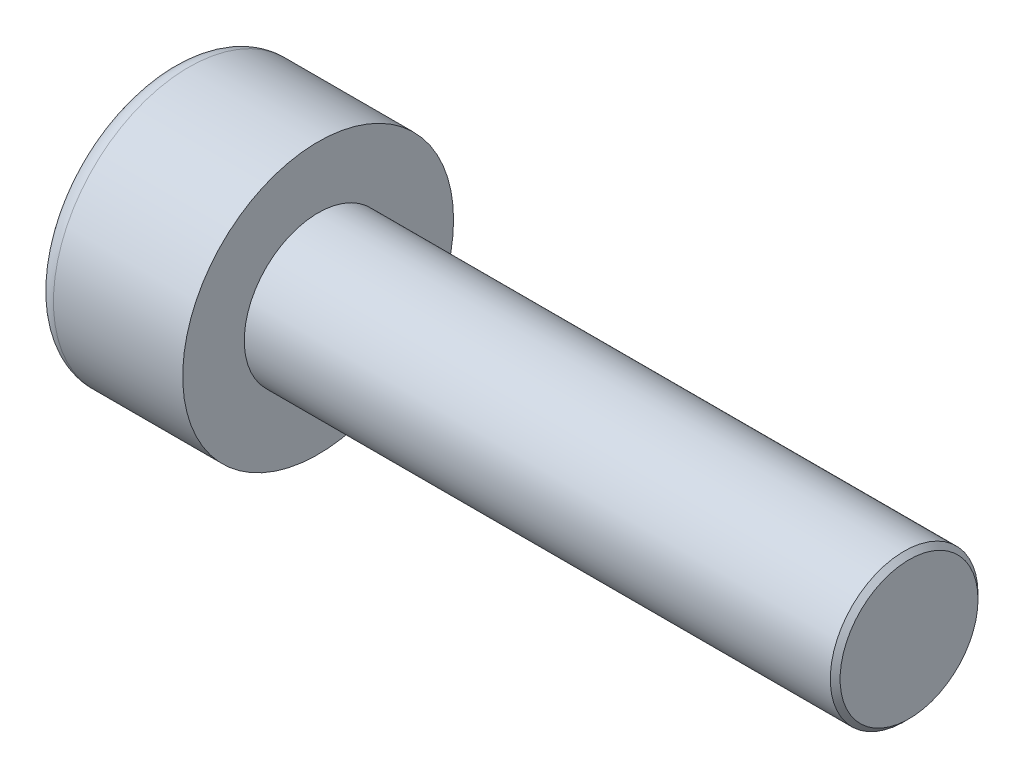
ISO-10303-21;
HEADER;
FILE_DESCRIPTION(('STEP AP214'),'2;1');
FILE_NAME('part.step','',(''),(''),'','','');
FILE_SCHEMA(('AUTOMOTIVE_DESIGN { 1 0 10303 214 1 1 1 1 }'));
ENDSEC;
DATA;
#1=APPLICATION_CONTEXT('core data for automotive mechanical design processes');
#2=APPLICATION_PROTOCOL_DEFINITION('international standard','automotive_design',2000,#1);
#3=PRODUCT_CONTEXT('',#1,'mechanical');
#4=PRODUCT('Part','Part','',(#3));
#5=PRODUCT_RELATED_PRODUCT_CATEGORY('part','',(#4));
#6=PRODUCT_DEFINITION_FORMATION('','',#4);
#7=PRODUCT_DEFINITION_CONTEXT('part definition',#1,'design');
#8=PRODUCT_DEFINITION('design','',#6,#7);
#9=PRODUCT_DEFINITION_SHAPE('','',#8);
#10=(LENGTH_UNIT() NAMED_UNIT(*) SI_UNIT(.MILLI.,.METRE.));
#11=(NAMED_UNIT(*) PLANE_ANGLE_UNIT() SI_UNIT($,.RADIAN.));
#12=(NAMED_UNIT(*) SI_UNIT($,.STERADIAN.) SOLID_ANGLE_UNIT());
#13=UNCERTAINTY_MEASURE_WITH_UNIT(LENGTH_MEASURE(1.E-05),#10,'distance_accuracy_value','');
#14=(GEOMETRIC_REPRESENTATION_CONTEXT(3) GLOBAL_UNCERTAINTY_ASSIGNED_CONTEXT((#13)) GLOBAL_UNIT_ASSIGNED_CONTEXT((#10,
#11,#12)) REPRESENTATION_CONTEXT('',''));
#15=CARTESIAN_POINT('',(0.,0.,0.));
#16=DIRECTION('',(0.,0.,1.));
#17=DIRECTION('',(1.,0.,0.));
#18=AXIS2_PLACEMENT_3D('',#15,#16,#17);
#19=CARTESIAN_POINT('',(1.3,-2.5,0.));
#20=DIRECTION('',(-1.,0.,0.));
#21=DIRECTION('',(0.,0.,1.));
#22=AXIS2_PLACEMENT_3D('',#19,#20,#21);
#23=PLANE('',#22);
#24=DIRECTION('',(0.,-0.866025403784438,-0.500000000000001));
#25=VECTOR('',#24,1.);
#26=CARTESIAN_POINT('',(1.3,0.,1.44337567297406));
#27=LINE('',#26,#25);
#28=CARTESIAN_POINT('',(1.3,-0.625,1.08253175473055));
#29=VERTEX_POINT('',#28);
#30=CARTESIAN_POINT('',(1.3,-1.25,0.721687836487031));
#31=VERTEX_POINT('',#30);
#32=EDGE_CURVE('E159',#29,#31,#27,.T.);
#33=ORIENTED_EDGE('',*,*,#32,.F.);
#34=CARTESIAN_POINT('',(1.3,0.,0.));
#35=DIRECTION('',(-1.,0.,0.));
#36=DIRECTION('',(0.,0.,1.));
#37=AXIS2_PLACEMENT_3D('',#34,#35,#36);
#38=CIRCLE('',#37,1.25);
#39=CARTESIAN_POINT('',(1.3,-1.25,0.));
#40=VERTEX_POINT('',#39);
#41=EDGE_CURVE('E54',#29,#40,#38,.F.);
#42=ORIENTED_EDGE('',*,*,#41,.T.);
#43=DIRECTION('',(0.,0.,-1.));
#44=VECTOR('',#43,1.);
#45=CARTESIAN_POINT('',(1.3,-1.25,0.721687836487031));
#46=LINE('',#45,#44);
#47=EDGE_CURVE('E164',#31,#40,#46,.T.);
#48=ORIENTED_EDGE('',*,*,#47,.F.);
#49=EDGE_LOOP('',(#33,#42,#48));
#50=FACE_BOUND('',#49,.T.);
#51=ADVANCED_FACE('F39',(#50),#23,.T.);
#52=CARTESIAN_POINT('',(1.3,-1.25,-0.721687836487037));
#53=VERTEX_POINT('',#52);
#54=EDGE_CURVE('E163',#40,#53,#46,.T.);
#55=ORIENTED_EDGE('',*,*,#54,.F.);
#56=CARTESIAN_POINT('',(1.3,-0.625,-1.08253175473055));
#57=VERTEX_POINT('',#56);
#58=EDGE_CURVE('E139',#40,#57,#38,.F.);
#59=ORIENTED_EDGE('',*,*,#58,.T.);
#60=DIRECTION('',(0.,0.866025403784438,-0.5));
#61=VECTOR('',#60,1.);
#62=CARTESIAN_POINT('',(1.3,-1.25,-0.721687836487037));
#63=LINE('',#62,#61);
#64=EDGE_CURVE('E147',#53,#57,#63,.T.);
#65=ORIENTED_EDGE('',*,*,#64,.F.);
#66=EDGE_LOOP('',(#55,#59,#65));
#67=FACE_BOUND('',#66,.T.);
#68=ADVANCED_FACE('F220',(#67),#23,.T.);
#69=CARTESIAN_POINT('',(1.3,0.,-1.44337567297407));
#70=VERTEX_POINT('',#69);
#71=EDGE_CURVE('E137',#57,#70,#63,.T.);
#72=ORIENTED_EDGE('',*,*,#71,.F.);
#73=CARTESIAN_POINT('',(1.3,0.625,-1.08253175473055));
#74=VERTEX_POINT('',#73);
#75=EDGE_CURVE('E121',#57,#74,#38,.F.);
#76=ORIENTED_EDGE('',*,*,#75,.T.);
#77=DIRECTION('',(0.,0.866025403784438,0.5));
#78=VECTOR('',#77,1.);
#79=CARTESIAN_POINT('',(1.3,0.,-1.44337567297407));
#80=LINE('',#79,#78);
#81=EDGE_CURVE('E135',#70,#74,#80,.T.);
#82=ORIENTED_EDGE('',*,*,#81,.F.);
#83=EDGE_LOOP('',(#72,#76,#82));
#84=FACE_BOUND('',#83,.T.);
#85=ADVANCED_FACE('F133',(#84),#23,.T.);
#86=CARTESIAN_POINT('',(1.3,1.25,-0.721687836487033));
#87=VERTEX_POINT('',#86);
#88=EDGE_CURVE('E141',#74,#87,#80,.T.);
#89=ORIENTED_EDGE('',*,*,#88,.F.);
#90=CARTESIAN_POINT('',(1.3,0.,0.));
#91=DIRECTION('',(1.,0.,0.));
#92=DIRECTION('',(0.,0.,-1.));
#93=AXIS2_PLACEMENT_3D('',#90,#91,#92);
#94=CIRCLE('',#93,1.25);
#95=CARTESIAN_POINT('',(1.3,1.25,0.));
#96=VERTEX_POINT('',#95);
#97=EDGE_CURVE('E119',#74,#96,#94,.T.);
#98=ORIENTED_EDGE('',*,*,#97,.T.);
#99=DIRECTION('',(0.,0.,1.));
#100=VECTOR('',#99,1.);
#101=CARTESIAN_POINT('',(1.3,1.25,-0.721687836487033));
#102=LINE('',#101,#100);
#103=EDGE_CURVE('E144',#87,#96,#102,.T.);
#104=ORIENTED_EDGE('',*,*,#103,.F.);
#105=EDGE_LOOP('',(#89,#98,#104));
#106=FACE_BOUND('',#105,.T.);
#107=ADVANCED_FACE('F142',(#106),#23,.T.);
#108=CARTESIAN_POINT('',(1.3,1.25,0.721687836487031));
#109=VERTEX_POINT('',#108);
#110=EDGE_CURVE('E151',#96,#109,#102,.T.);
#111=ORIENTED_EDGE('',*,*,#110,.F.);
#112=CARTESIAN_POINT('',(1.3,0.625,1.08253175473055));
#113=VERTEX_POINT('',#112);
#114=EDGE_CURVE('E124',#96,#113,#38,.F.);
#115=ORIENTED_EDGE('',*,*,#114,.T.);
#116=DIRECTION('',(0.,-0.866025403784438,0.5));
#117=VECTOR('',#116,1.);
#118=CARTESIAN_POINT('',(1.3,1.25,0.721687836487031));
#119=LINE('',#118,#117);
#120=EDGE_CURVE('E156',#109,#113,#119,.T.);
#121=ORIENTED_EDGE('',*,*,#120,.F.);
#122=EDGE_LOOP('',(#111,#115,#121));
#123=FACE_BOUND('',#122,.T.);
#124=ADVANCED_FACE('F232',(#123),#23,.T.);
#125=CARTESIAN_POINT('',(1.3,0.,1.44337567297406));
#126=VERTEX_POINT('',#125);
#127=EDGE_CURVE('E155',#113,#126,#119,.T.);
#128=ORIENTED_EDGE('',*,*,#127,.F.);
#129=EDGE_CURVE('E200',#113,#29,#38,.F.);
#130=ORIENTED_EDGE('',*,*,#129,.T.);
#131=EDGE_CURVE('E160',#126,#29,#27,.T.);
#132=ORIENTED_EDGE('',*,*,#131,.F.);
#133=EDGE_LOOP('',(#128,#130,#132));
#134=FACE_BOUND('',#133,.T.);
#135=ADVANCED_FACE('F223',(#134),#23,.T.);
#136=CARTESIAN_POINT('',(0.,0.,0.));
#137=DIRECTION('',(1.,0.,0.));
#138=DIRECTION('',(0.,0.,-1.));
#139=AXIS2_PLACEMENT_3D('',#136,#137,#138);
#140=PLANE('',#139);
#141=CARTESIAN_POINT('',(0.,0.,0.));
#142=DIRECTION('',(1.,0.,0.));
#143=DIRECTION('',(0.,0.,-1.));
#144=AXIS2_PLACEMENT_3D('',#141,#142,#143);
#145=CIRCLE('',#144,2.375);
#146=CARTESIAN_POINT('',(0.,0.,-2.375));
#147=VERTEX_POINT('',#146);
#148=EDGE_CURVE('E205',#147,#147,#145,.F.);
#149=ORIENTED_EDGE('',*,*,#148,.T.);
#150=EDGE_LOOP('',(#149));
#151=FACE_BOUND('',#150,.T.);
#152=DIRECTION('',(0.,0.866025403784438,-0.5));
#153=VECTOR('',#152,1.);
#154=CARTESIAN_POINT('',(0.,-1.25,-0.721687836487037));
#155=LINE('',#154,#153);
#156=CARTESIAN_POINT('',(0.,-1.25,-0.721687836487037));
#157=VERTEX_POINT('',#156);
#158=CARTESIAN_POINT('',(0.,0.,-1.44337567297407));
#159=VERTEX_POINT('',#158);
#160=EDGE_CURVE('E62',#157,#159,#155,.T.);
#161=ORIENTED_EDGE('',*,*,#160,.T.);
#162=DIRECTION('',(0.,0.866025403784438,0.5));
#163=VECTOR('',#162,1.);
#164=CARTESIAN_POINT('',(0.,0.,-1.44337567297407));
#165=LINE('',#164,#163);
#166=CARTESIAN_POINT('',(0.,1.25,-0.721687836487033));
#167=VERTEX_POINT('',#166);
#168=EDGE_CURVE('E169',#159,#167,#165,.T.);
#169=ORIENTED_EDGE('',*,*,#168,.T.);
#170=DIRECTION('',(0.,0.,1.));
#171=VECTOR('',#170,1.);
#172=CARTESIAN_POINT('',(0.,1.25,-0.721687836487033));
#173=LINE('',#172,#171);
#174=CARTESIAN_POINT('',(0.,1.25,0.721687836487031));
#175=VERTEX_POINT('',#174);
#176=EDGE_CURVE('E172',#167,#175,#173,.T.);
#177=ORIENTED_EDGE('',*,*,#176,.T.);
#178=DIRECTION('',(0.,-0.866025403784438,0.5));
#179=VECTOR('',#178,1.);
#180=CARTESIAN_POINT('',(0.,1.25,0.721687836487031));
#181=LINE('',#180,#179);
#182=CARTESIAN_POINT('',(0.,0.,1.44337567297406));
#183=VERTEX_POINT('',#182);
#184=EDGE_CURVE('E175',#175,#183,#181,.T.);
#185=ORIENTED_EDGE('',*,*,#184,.T.);
#186=DIRECTION('',(0.,-0.866025403784438,-0.500000000000001));
#187=VECTOR('',#186,1.);
#188=CARTESIAN_POINT('',(0.,0.,1.44337567297406));
#189=LINE('',#188,#187);
#190=CARTESIAN_POINT('',(0.,-1.25,0.721687836487031));
#191=VERTEX_POINT('',#190);
#192=EDGE_CURVE('E178',#183,#191,#189,.T.);
#193=ORIENTED_EDGE('',*,*,#192,.T.);
#194=DIRECTION('',(0.,0.,-1.));
#195=VECTOR('',#194,1.);
#196=CARTESIAN_POINT('',(0.,-1.25,0.721687836487031));
#197=LINE('',#196,#195);
#198=EDGE_CURVE('E181',#191,#157,#197,.T.);
#199=ORIENTED_EDGE('',*,*,#198,.T.);
#200=EDGE_LOOP('',(#161,#169,#177,#185,#193,#199));
#201=FACE_BOUND('',#200,.T.);
#202=ADVANCED_FACE('F231',(#151,#201),#140,.F.);
#203=CARTESIAN_POINT('',(3.,0.,0.));
#204=DIRECTION('',(1.,0.,0.));
#205=DIRECTION('',(0.,0.,-1.));
#206=AXIS2_PLACEMENT_3D('',#203,#204,#205);
#207=PLANE('',#206);
#208=CARTESIAN_POINT('',(3.,0.,0.));
#209=DIRECTION('',(1.,0.,0.));
#210=DIRECTION('',(0.,0.,-1.));
#211=AXIS2_PLACEMENT_3D('',#208,#209,#210);
#212=CIRCLE('',#211,2.75);
#213=CARTESIAN_POINT('',(3.,0.,-2.75));
#214=VERTEX_POINT('',#213);
#215=EDGE_CURVE('E197',#214,#214,#212,.T.);
#216=ORIENTED_EDGE('',*,*,#215,.T.);
#217=EDGE_LOOP('',(#216));
#218=FACE_BOUND('',#217,.T.);
#219=CARTESIAN_POINT('',(3.,0.,0.));
#220=DIRECTION('',(1.,0.,0.));
#221=DIRECTION('',(0.,0.,-1.));
#222=AXIS2_PLACEMENT_3D('',#219,#220,#221);
#223=CIRCLE('',#222,1.5);
#224=CARTESIAN_POINT('',(3.,0.,-1.5));
#225=VERTEX_POINT('',#224);
#226=EDGE_CURVE('E194',#225,#225,#223,.T.);
#227=ORIENTED_EDGE('',*,*,#226,.F.);
#228=EDGE_LOOP('',(#227));
#229=FACE_BOUND('',#228,.T.);
#230=ADVANCED_FACE('F238',(#218,#229),#207,.T.);
#231=CARTESIAN_POINT('',(3.,0.,0.));
#232=DIRECTION('',(-1.,0.,0.));
#233=DIRECTION('',(0.,0.,1.));
#234=AXIS2_PLACEMENT_3D('',#231,#232,#233);
#235=CYLINDRICAL_SURFACE('',#234,2.75);
#236=CARTESIAN_POINT('',(0.375,0.,0.));
#237=DIRECTION('',(1.,0.,0.));
#238=DIRECTION('',(0.,0.,-1.));
#239=AXIS2_PLACEMENT_3D('',#236,#237,#238);
#240=CIRCLE('',#239,2.75);
#241=CARTESIAN_POINT('',(0.375,0.,-2.75));
#242=VERTEX_POINT('',#241);
#243=EDGE_CURVE('E202',#242,#242,#240,.T.);
#244=ORIENTED_EDGE('',*,*,#243,.T.);
#245=EDGE_LOOP('',(#244));
#246=FACE_BOUND('',#245,.T.);
#247=ORIENTED_EDGE('',*,*,#215,.F.);
#248=EDGE_LOOP('',(#247));
#249=FACE_BOUND('',#248,.T.);
#250=ADVANCED_FACE('F283',(#246,#249),#235,.T.);
#251=CARTESIAN_POINT('',(15.,0.,0.));
#252=DIRECTION('',(-1.,0.,0.));
#253=DIRECTION('',(0.,0.,1.));
#254=AXIS2_PLACEMENT_3D('',#251,#252,#253);
#255=CYLINDRICAL_SURFACE('',#254,1.5);
#256=CARTESIAN_POINT('',(14.9,0.,0.));
#257=DIRECTION('',(1.,0.,0.));
#258=DIRECTION('',(0.,0.,-1.));
#259=AXIS2_PLACEMENT_3D('',#256,#257,#258);
#260=CIRCLE('',#259,1.5);
#261=CARTESIAN_POINT('',(14.9,0.,-1.5));
#262=VERTEX_POINT('',#261);
#263=EDGE_CURVE('E11',#262,#262,#260,.F.);
#264=ORIENTED_EDGE('',*,*,#263,.T.);
#265=EDGE_LOOP('',(#264));
#266=FACE_BOUND('',#265,.T.);
#267=ORIENTED_EDGE('',*,*,#226,.T.);
#268=EDGE_LOOP('',(#267));
#269=FACE_BOUND('',#268,.T.);
#270=ADVANCED_FACE('F280',(#266,#269),#255,.T.);
#271=CARTESIAN_POINT('',(15.,0.,0.));
#272=DIRECTION('',(1.,0.,0.));
#273=DIRECTION('',(0.,0.,-1.));
#274=AXIS2_PLACEMENT_3D('',#271,#272,#273);
#275=PLANE('',#274);
#276=CARTESIAN_POINT('',(15.,0.,0.));
#277=DIRECTION('',(1.,0.,0.));
#278=DIRECTION('',(0.,0.,-1.));
#279=AXIS2_PLACEMENT_3D('',#276,#277,#278);
#280=CIRCLE('',#279,1.4);
#281=CARTESIAN_POINT('',(15.,0.,-1.4));
#282=VERTEX_POINT('',#281);
#283=EDGE_CURVE('E47',#282,#282,#280,.T.);
#284=ORIENTED_EDGE('',*,*,#283,.T.);
#285=EDGE_LOOP('',(#284));
#286=FACE_BOUND('',#285,.T.);
#287=ADVANCED_FACE('F210',(#286),#275,.T.);
#288=CARTESIAN_POINT('',(1.3,-1.25,-0.721687836487037));
#289=DIRECTION('',(0.,0.5,0.866025403784439));
#290=DIRECTION('',(0.,-0.866025403784439,0.5));
#291=AXIS2_PLACEMENT_3D('',#288,#289,#290);
#292=PLANE('',#291);
#293=ORIENTED_EDGE('',*,*,#160,.F.);
#294=DIRECTION('',(-1.,0.,0.));
#295=VECTOR('',#294,1.);
#296=CARTESIAN_POINT('',(1.3,-1.25,-0.721687836487037));
#297=LINE('',#296,#295);
#298=EDGE_CURVE('E167',#53,#157,#297,.T.);
#299=ORIENTED_EDGE('',*,*,#298,.F.);
#300=ORIENTED_EDGE('',*,*,#64,.T.);
#301=ORIENTED_EDGE('',*,*,#71,.T.);
#302=DIRECTION('',(-1.,0.,0.));
#303=VECTOR('',#302,1.);
#304=CARTESIAN_POINT('',(1.3,0.,-1.44337567297407));
#305=LINE('',#304,#303);
#306=EDGE_CURVE('E150',#70,#159,#305,.T.);
#307=ORIENTED_EDGE('',*,*,#306,.T.);
#308=EDGE_LOOP('',(#293,#299,#300,#301,#307));
#309=FACE_BOUND('',#308,.T.);
#310=ADVANCED_FACE('F254',(#309),#292,.T.);
#311=CARTESIAN_POINT('',(1.3,0.,-1.44337567297407));
#312=DIRECTION('',(0.,-0.5,0.866025403784438));
#313=DIRECTION('',(0.,-0.866025403784439,-0.5));
#314=AXIS2_PLACEMENT_3D('',#311,#312,#313);
#315=PLANE('',#314);
#316=ORIENTED_EDGE('',*,*,#168,.F.);
#317=ORIENTED_EDGE('',*,*,#306,.F.);
#318=ORIENTED_EDGE('',*,*,#81,.T.);
#319=ORIENTED_EDGE('',*,*,#88,.T.);
#320=DIRECTION('',(-1.,0.,0.));
#321=VECTOR('',#320,1.);
#322=CARTESIAN_POINT('',(1.3,1.25,-0.721687836487033));
#323=LINE('',#322,#321);
#324=EDGE_CURVE('E191',#87,#167,#323,.T.);
#325=ORIENTED_EDGE('',*,*,#324,.T.);
#326=EDGE_LOOP('',(#316,#317,#318,#319,#325));
#327=FACE_BOUND('',#326,.T.);
#328=ADVANCED_FACE('F149',(#327),#315,.T.);
#329=CARTESIAN_POINT('',(1.3,1.25,-0.721687836487033));
#330=DIRECTION('',(0.,-1.,0.));
#331=DIRECTION('',(0.,0.,-1.));
#332=AXIS2_PLACEMENT_3D('',#329,#330,#331);
#333=PLANE('',#332);
#334=ORIENTED_EDGE('',*,*,#176,.F.);
#335=ORIENTED_EDGE('',*,*,#324,.F.);
#336=ORIENTED_EDGE('',*,*,#103,.T.);
#337=ORIENTED_EDGE('',*,*,#110,.T.);
#338=DIRECTION('',(-1.,0.,0.));
#339=VECTOR('',#338,1.);
#340=CARTESIAN_POINT('',(1.3,1.25,0.721687836487031));
#341=LINE('',#340,#339);
#342=EDGE_CURVE('E189',#109,#175,#341,.T.);
#343=ORIENTED_EDGE('',*,*,#342,.T.);
#344=EDGE_LOOP('',(#334,#335,#336,#337,#343));
#345=FACE_BOUND('',#344,.T.);
#346=ADVANCED_FACE('F252',(#345),#333,.T.);
#347=CARTESIAN_POINT('',(1.3,1.25,0.721687836487031));
#348=DIRECTION('',(0.,-0.5,-0.866025403784439));
#349=DIRECTION('',(0.,0.866025403784439,-0.5));
#350=AXIS2_PLACEMENT_3D('',#347,#348,#349);
#351=PLANE('',#350);
#352=ORIENTED_EDGE('',*,*,#184,.F.);
#353=ORIENTED_EDGE('',*,*,#342,.F.);
#354=ORIENTED_EDGE('',*,*,#120,.T.);
#355=ORIENTED_EDGE('',*,*,#127,.T.);
#356=DIRECTION('',(-1.,0.,0.));
#357=VECTOR('',#356,1.);
#358=CARTESIAN_POINT('',(1.3,0.,1.44337567297406));
#359=LINE('',#358,#357);
#360=EDGE_CURVE('E187',#126,#183,#359,.T.);
#361=ORIENTED_EDGE('',*,*,#360,.T.);
#362=EDGE_LOOP('',(#352,#353,#354,#355,#361));
#363=FACE_BOUND('',#362,.T.);
#364=ADVANCED_FACE('F249',(#363),#351,.T.);
#365=CARTESIAN_POINT('',(1.3,0.,1.44337567297406));
#366=DIRECTION('',(0.,0.500000000000001,-0.866025403784438));
#367=DIRECTION('',(0.,0.866025403784438,0.500000000000001));
#368=AXIS2_PLACEMENT_3D('',#365,#366,#367);
#369=PLANE('',#368);
#370=ORIENTED_EDGE('',*,*,#192,.F.);
#371=ORIENTED_EDGE('',*,*,#360,.F.);
#372=ORIENTED_EDGE('',*,*,#131,.T.);
#373=ORIENTED_EDGE('',*,*,#32,.T.);
#374=DIRECTION('',(-1.,0.,0.));
#375=VECTOR('',#374,1.);
#376=CARTESIAN_POINT('',(1.3,-1.25,0.721687836487031));
#377=LINE('',#376,#375);
#378=EDGE_CURVE('E185',#31,#191,#377,.T.);
#379=ORIENTED_EDGE('',*,*,#378,.T.);
#380=EDGE_LOOP('',(#370,#371,#372,#373,#379));
#381=FACE_BOUND('',#380,.T.);
#382=ADVANCED_FACE('F263',(#381),#369,.T.);
#383=CARTESIAN_POINT('',(1.3,-1.25,0.721687836487031));
#384=DIRECTION('',(0.,1.,0.));
#385=DIRECTION('',(0.,0.,1.));
#386=AXIS2_PLACEMENT_3D('',#383,#384,#385);
#387=PLANE('',#386);
#388=ORIENTED_EDGE('',*,*,#198,.F.);
#389=ORIENTED_EDGE('',*,*,#378,.F.);
#390=ORIENTED_EDGE('',*,*,#47,.T.);
#391=ORIENTED_EDGE('',*,*,#54,.T.);
#392=ORIENTED_EDGE('',*,*,#298,.T.);
#393=EDGE_LOOP('',(#388,#389,#390,#391,#392));
#394=FACE_BOUND('',#393,.T.);
#395=ADVANCED_FACE('F116',(#394),#387,.T.);
#396=CARTESIAN_POINT('',(1.3,0.,0.));
#397=DIRECTION('',(-1.,0.,0.));
#398=DIRECTION('',(0.,0.,1.));
#399=AXIS2_PLACEMENT_3D('',#396,#397,#398);
#400=CONICAL_SURFACE('',#399,1.25,1.04719755119659);
#401=CARTESIAN_POINT('',(2.02168783648704,0.,0.));
#402=VERTEX_POINT('',#401);
#403=VERTEX_LOOP('',#402);
#404=FACE_BOUND('',#403,.T.);
#405=ORIENTED_EDGE('',*,*,#97,.F.);
#406=ORIENTED_EDGE('',*,*,#75,.F.);
#407=ORIENTED_EDGE('',*,*,#58,.F.);
#408=ORIENTED_EDGE('',*,*,#41,.F.);
#409=ORIENTED_EDGE('',*,*,#129,.F.);
#410=ORIENTED_EDGE('',*,*,#114,.F.);
#411=EDGE_LOOP('',(#405,#406,#407,#408,#409,#410));
#412=FACE_BOUND('',#411,.T.);
#413=ADVANCED_FACE('F113',(#404,#412),#400,.F.);
#414=CARTESIAN_POINT('',(0.375,0.,0.));
#415=DIRECTION('',(1.,0.,0.));
#416=DIRECTION('',(0.,0.,-1.));
#417=AXIS2_PLACEMENT_3D('',#414,#415,#416);
#418=TOROIDAL_SURFACE('',#417,2.375,0.375);
#419=ORIENTED_EDGE('',*,*,#148,.F.);
#420=EDGE_LOOP('',(#419));
#421=FACE_BOUND('',#420,.T.);
#422=ORIENTED_EDGE('',*,*,#243,.F.);
#423=EDGE_LOOP('',(#422));
#424=FACE_BOUND('',#423,.T.);
#425=ADVANCED_FACE('F115',(#421,#424),#418,.T.);
#426=CARTESIAN_POINT('',(15.,0.,0.));
#427=DIRECTION('',(-1.,0.,0.));
#428=DIRECTION('',(0.,0.,1.));
#429=AXIS2_PLACEMENT_3D('',#426,#427,#428);
#430=CONICAL_SURFACE('',#429,1.4,0.785398163397443);
#431=ORIENTED_EDGE('',*,*,#263,.F.);
#432=EDGE_LOOP('',(#431));
#433=FACE_BOUND('',#432,.T.);
#434=ORIENTED_EDGE('',*,*,#283,.F.);
#435=EDGE_LOOP('',(#434));
#436=FACE_BOUND('',#435,.T.);
#437=ADVANCED_FACE('F41',(#433,#436),#430,.T.);
#438=CLOSED_SHELL('',(#51,#68,#85,#107,#124,#135,#202,#230,#250,#270,#287,#310,#328,#346,#364,
#382,#395,#413,#425,#437));
#439=MANIFOLD_SOLID_BREP('B2',#438);
#440=ADVANCED_BREP_SHAPE_REPRESENTATION('',(#18,#439),#14);
#441=SHAPE_DEFINITION_REPRESENTATION(#9,#440);
ENDSEC;
END-ISO-10303-21;
